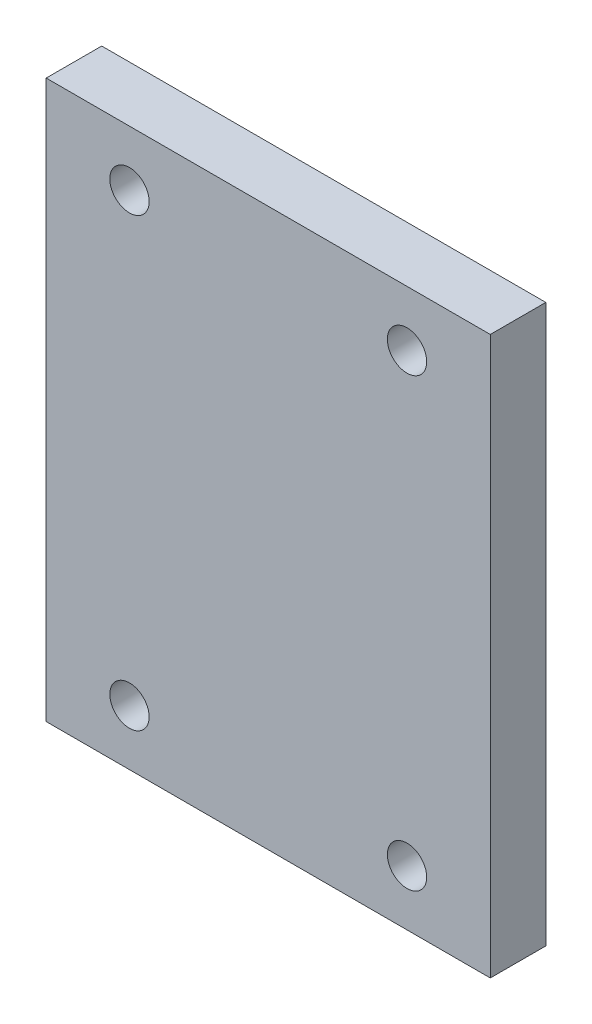
ISO-10303-21;
HEADER;
FILE_DESCRIPTION(('STEP AP214'),'2;1');
FILE_NAME('part.step','',(''),(''),'','','');
FILE_SCHEMA(('AUTOMOTIVE_DESIGN { 1 0 10303 214 1 1 1 1 }'));
ENDSEC;
DATA;
#1=APPLICATION_CONTEXT('core data for automotive mechanical design processes');
#2=APPLICATION_PROTOCOL_DEFINITION('international standard','automotive_design',2000,#1);
#3=PRODUCT_CONTEXT('',#1,'mechanical');
#4=PRODUCT('Part','Part','',(#3));
#5=PRODUCT_RELATED_PRODUCT_CATEGORY('part','',(#4));
#6=PRODUCT_DEFINITION_FORMATION('','',#4);
#7=PRODUCT_DEFINITION_CONTEXT('part definition',#1,'design');
#8=PRODUCT_DEFINITION('design','',#6,#7);
#9=PRODUCT_DEFINITION_SHAPE('','',#8);
#10=(LENGTH_UNIT() NAMED_UNIT(*) SI_UNIT(.MILLI.,.METRE.));
#11=(NAMED_UNIT(*) PLANE_ANGLE_UNIT() SI_UNIT($,.RADIAN.));
#12=(NAMED_UNIT(*) SI_UNIT($,.STERADIAN.) SOLID_ANGLE_UNIT());
#13=UNCERTAINTY_MEASURE_WITH_UNIT(LENGTH_MEASURE(1.E-05),#10,'distance_accuracy_value','');
#14=(GEOMETRIC_REPRESENTATION_CONTEXT(3) GLOBAL_UNCERTAINTY_ASSIGNED_CONTEXT((#13)) GLOBAL_UNIT_ASSIGNED_CONTEXT((#10,
#11,#12)) REPRESENTATION_CONTEXT('',''));
#15=CARTESIAN_POINT('',(0.,0.,0.));
#16=DIRECTION('',(0.,0.,1.));
#17=DIRECTION('',(1.,0.,0.));
#18=AXIS2_PLACEMENT_3D('',#15,#16,#17);
#19=CARTESIAN_POINT('',(-25.4,-31.877,6.35));
#20=DIRECTION('',(1.,0.,0.));
#21=DIRECTION('',(0.,0.,-1.));
#22=AXIS2_PLACEMENT_3D('',#19,#20,#21);
#23=PLANE('',#22);
#24=DIRECTION('',(0.,-1.,0.));
#25=VECTOR('',#24,1.);
#26=CARTESIAN_POINT('',(-25.4,-31.877,0.));
#27=LINE('',#26,#25);
#28=CARTESIAN_POINT('',(-25.4,31.877,0.));
#29=VERTEX_POINT('',#28);
#30=CARTESIAN_POINT('',(-25.4,-31.877,0.));
#31=VERTEX_POINT('',#30);
#32=EDGE_CURVE('E96',#29,#31,#27,.T.);
#33=ORIENTED_EDGE('',*,*,#32,.T.);
#34=DIRECTION('',(0.,0.,-1.));
#35=VECTOR('',#34,1.);
#36=CARTESIAN_POINT('',(-25.4,-31.877,6.35));
#37=LINE('',#36,#35);
#38=CARTESIAN_POINT('',(-25.4,-31.877,6.35));
#39=VERTEX_POINT('',#38);
#40=EDGE_CURVE('E11',#39,#31,#37,.T.);
#41=ORIENTED_EDGE('',*,*,#40,.F.);
#42=DIRECTION('',(0.,-1.,0.));
#43=VECTOR('',#42,1.);
#44=CARTESIAN_POINT('',(-25.4,-31.877,6.35));
#45=LINE('',#44,#43);
#46=CARTESIAN_POINT('',(-25.4,31.877,6.35));
#47=VERTEX_POINT('',#46);
#48=EDGE_CURVE('E84',#47,#39,#45,.T.);
#49=ORIENTED_EDGE('',*,*,#48,.F.);
#50=DIRECTION('',(0.,0.,-1.));
#51=VECTOR('',#50,1.);
#52=CARTESIAN_POINT('',(-25.4,31.877,6.35));
#53=LINE('',#52,#51);
#54=EDGE_CURVE('E92',#47,#29,#53,.T.);
#55=ORIENTED_EDGE('',*,*,#54,.T.);
#56=EDGE_LOOP('',(#33,#41,#49,#55));
#57=FACE_BOUND('',#56,.T.);
#58=ADVANCED_FACE('F33',(#57),#23,.F.);
#59=CARTESIAN_POINT('',(25.4,-31.877,6.35));
#60=DIRECTION('',(0.,1.,0.));
#61=DIRECTION('',(0.,0.,1.));
#62=AXIS2_PLACEMENT_3D('',#59,#60,#61);
#63=PLANE('',#62);
#64=DIRECTION('',(1.,0.,0.));
#65=VECTOR('',#64,1.);
#66=CARTESIAN_POINT('',(25.4,-31.877,0.));
#67=LINE('',#66,#65);
#68=CARTESIAN_POINT('',(25.4,-31.877,0.));
#69=VERTEX_POINT('',#68);
#70=EDGE_CURVE('E88',#31,#69,#67,.T.);
#71=ORIENTED_EDGE('',*,*,#70,.T.);
#72=DIRECTION('',(0.,0.,-1.));
#73=VECTOR('',#72,1.);
#74=CARTESIAN_POINT('',(25.4,-31.877,6.35));
#75=LINE('',#74,#73);
#76=CARTESIAN_POINT('',(25.4,-31.877,6.35));
#77=VERTEX_POINT('',#76);
#78=EDGE_CURVE('E41',#77,#69,#75,.T.);
#79=ORIENTED_EDGE('',*,*,#78,.F.);
#80=DIRECTION('',(1.,0.,0.));
#81=VECTOR('',#80,1.);
#82=CARTESIAN_POINT('',(25.4,-31.877,6.35));
#83=LINE('',#82,#81);
#84=EDGE_CURVE('E79',#39,#77,#83,.T.);
#85=ORIENTED_EDGE('',*,*,#84,.F.);
#86=ORIENTED_EDGE('',*,*,#40,.T.);
#87=EDGE_LOOP('',(#71,#79,#85,#86));
#88=FACE_BOUND('',#87,.T.);
#89=ADVANCED_FACE('F87',(#88),#63,.F.);
#90=CARTESIAN_POINT('',(25.4,-31.877,6.35));
#91=DIRECTION('',(-1.,0.,0.));
#92=DIRECTION('',(0.,0.,1.));
#93=AXIS2_PLACEMENT_3D('',#90,#91,#92);
#94=PLANE('',#93);
#95=DIRECTION('',(0.,1.,0.));
#96=VECTOR('',#95,1.);
#97=CARTESIAN_POINT('',(25.4,-31.877,0.));
#98=LINE('',#97,#96);
#99=CARTESIAN_POINT('',(25.4,31.877,0.));
#100=VERTEX_POINT('',#99);
#101=EDGE_CURVE('E66',#69,#100,#98,.T.);
#102=ORIENTED_EDGE('',*,*,#101,.T.);
#103=DIRECTION('',(0.,0.,-1.));
#104=VECTOR('',#103,1.);
#105=CARTESIAN_POINT('',(25.4,31.877,6.35));
#106=LINE('',#105,#104);
#107=CARTESIAN_POINT('',(25.4,31.877,6.35));
#108=VERTEX_POINT('',#107);
#109=EDGE_CURVE('E89',#108,#100,#106,.T.);
#110=ORIENTED_EDGE('',*,*,#109,.F.);
#111=DIRECTION('',(0.,1.,0.));
#112=VECTOR('',#111,1.);
#113=CARTESIAN_POINT('',(25.4,-31.877,6.35));
#114=LINE('',#113,#112);
#115=EDGE_CURVE('E82',#77,#108,#114,.T.);
#116=ORIENTED_EDGE('',*,*,#115,.F.);
#117=ORIENTED_EDGE('',*,*,#78,.T.);
#118=EDGE_LOOP('',(#102,#110,#116,#117));
#119=FACE_BOUND('',#118,.T.);
#120=ADVANCED_FACE('F90',(#119),#94,.F.);
#121=CARTESIAN_POINT('',(25.4,31.877,6.35));
#122=DIRECTION('',(0.,-1.,0.));
#123=DIRECTION('',(0.,0.,-1.));
#124=AXIS2_PLACEMENT_3D('',#121,#122,#123);
#125=PLANE('',#124);
#126=DIRECTION('',(-1.,0.,0.));
#127=VECTOR('',#126,1.);
#128=CARTESIAN_POINT('',(25.4,31.877,0.));
#129=LINE('',#128,#127);
#130=EDGE_CURVE('E72',#100,#29,#129,.T.);
#131=ORIENTED_EDGE('',*,*,#130,.T.);
#132=ORIENTED_EDGE('',*,*,#54,.F.);
#133=DIRECTION('',(-1.,0.,0.));
#134=VECTOR('',#133,1.);
#135=CARTESIAN_POINT('',(25.4,31.877,6.35));
#136=LINE('',#135,#134);
#137=EDGE_CURVE('E49',#108,#47,#136,.T.);
#138=ORIENTED_EDGE('',*,*,#137,.F.);
#139=ORIENTED_EDGE('',*,*,#109,.T.);
#140=EDGE_LOOP('',(#131,#132,#138,#139));
#141=FACE_BOUND('',#140,.T.);
#142=ADVANCED_FACE('F104',(#141),#125,.F.);
#143=CARTESIAN_POINT('',(0.,0.,6.35));
#144=DIRECTION('',(0.,0.,1.));
#145=DIRECTION('',(1.,0.,0.));
#146=AXIS2_PLACEMENT_3D('',#143,#144,#145);
#147=PLANE('',#146);
#148=CARTESIAN_POINT('',(15.8749999999999,25.527,6.35));
#149=DIRECTION('',(0.,0.,-1.));
#150=DIRECTION('',(-1.,0.,0.));
#151=AXIS2_PLACEMENT_3D('',#148,#149,#150);
#152=CIRCLE('',#151,2.25);
#153=CARTESIAN_POINT('',(13.6249999999999,25.527,6.35));
#154=VERTEX_POINT('',#153);
#155=EDGE_CURVE('E127',#154,#154,#152,.T.);
#156=ORIENTED_EDGE('',*,*,#155,.T.);
#157=EDGE_LOOP('',(#156));
#158=FACE_BOUND('',#157,.T.);
#159=CARTESIAN_POINT('',(-15.8750000000001,25.527,6.35));
#160=DIRECTION('',(0.,0.,-1.));
#161=DIRECTION('',(-1.,0.,0.));
#162=AXIS2_PLACEMENT_3D('',#159,#160,#161);
#163=CIRCLE('',#162,2.25);
#164=CARTESIAN_POINT('',(-18.1250000000001,25.527,6.35));
#165=VERTEX_POINT('',#164);
#166=EDGE_CURVE('E121',#165,#165,#163,.T.);
#167=ORIENTED_EDGE('',*,*,#166,.T.);
#168=EDGE_LOOP('',(#167));
#169=FACE_BOUND('',#168,.T.);
#170=CARTESIAN_POINT('',(-15.8750000000001,-25.527,6.35));
#171=DIRECTION('',(0.,0.,-1.));
#172=DIRECTION('',(-1.,0.,0.));
#173=AXIS2_PLACEMENT_3D('',#170,#171,#172);
#174=CIRCLE('',#173,2.25);
#175=CARTESIAN_POINT('',(-18.1250000000001,-25.527,6.35));
#176=VERTEX_POINT('',#175);
#177=EDGE_CURVE('E115',#176,#176,#174,.T.);
#178=ORIENTED_EDGE('',*,*,#177,.T.);
#179=EDGE_LOOP('',(#178));
#180=FACE_BOUND('',#179,.T.);
#181=CARTESIAN_POINT('',(15.8749999999999,-25.527,6.35));
#182=DIRECTION('',(0.,0.,-1.));
#183=DIRECTION('',(-1.,0.,0.));
#184=AXIS2_PLACEMENT_3D('',#181,#182,#183);
#185=CIRCLE('',#184,2.25);
#186=CARTESIAN_POINT('',(13.6249999999999,-25.527,6.35));
#187=VERTEX_POINT('',#186);
#188=EDGE_CURVE('E99',#187,#187,#185,.T.);
#189=ORIENTED_EDGE('',*,*,#188,.T.);
#190=EDGE_LOOP('',(#189));
#191=FACE_BOUND('',#190,.T.);
#192=ORIENTED_EDGE('',*,*,#48,.T.);
#193=ORIENTED_EDGE('',*,*,#84,.T.);
#194=ORIENTED_EDGE('',*,*,#115,.T.);
#195=ORIENTED_EDGE('',*,*,#137,.T.);
#196=EDGE_LOOP('',(#192,#193,#194,#195));
#197=FACE_BOUND('',#196,.T.);
#198=ADVANCED_FACE('F80',(#158,#169,#180,#191,#197),#147,.T.);
#199=CARTESIAN_POINT('',(0.,0.,0.));
#200=DIRECTION('',(0.,0.,1.));
#201=DIRECTION('',(1.,0.,0.));
#202=AXIS2_PLACEMENT_3D('',#199,#200,#201);
#203=PLANE('',#202);
#204=CARTESIAN_POINT('',(15.8749999999999,25.527,0.));
#205=DIRECTION('',(0.,0.,-1.));
#206=DIRECTION('',(-1.,0.,0.));
#207=AXIS2_PLACEMENT_3D('',#204,#205,#206);
#208=CIRCLE('',#207,2.24999999999999);
#209=CARTESIAN_POINT('',(13.6249999999999,25.527,0.));
#210=VERTEX_POINT('',#209);
#211=EDGE_CURVE('E130',#210,#210,#208,.T.);
#212=ORIENTED_EDGE('',*,*,#211,.F.);
#213=EDGE_LOOP('',(#212));
#214=FACE_BOUND('',#213,.T.);
#215=CARTESIAN_POINT('',(-15.8750000000001,25.527,0.));
#216=DIRECTION('',(0.,0.,-1.));
#217=DIRECTION('',(-1.,0.,0.));
#218=AXIS2_PLACEMENT_3D('',#215,#216,#217);
#219=CIRCLE('',#218,2.24999999999999);
#220=CARTESIAN_POINT('',(-18.1250000000001,25.527,0.));
#221=VERTEX_POINT('',#220);
#222=EDGE_CURVE('E124',#221,#221,#219,.T.);
#223=ORIENTED_EDGE('',*,*,#222,.F.);
#224=EDGE_LOOP('',(#223));
#225=FACE_BOUND('',#224,.T.);
#226=CARTESIAN_POINT('',(-15.8750000000001,-25.527,0.));
#227=DIRECTION('',(0.,0.,-1.));
#228=DIRECTION('',(-1.,0.,0.));
#229=AXIS2_PLACEMENT_3D('',#226,#227,#228);
#230=CIRCLE('',#229,2.24999999999999);
#231=CARTESIAN_POINT('',(-18.1250000000001,-25.527,0.));
#232=VERTEX_POINT('',#231);
#233=EDGE_CURVE('E118',#232,#232,#230,.T.);
#234=ORIENTED_EDGE('',*,*,#233,.F.);
#235=EDGE_LOOP('',(#234));
#236=FACE_BOUND('',#235,.T.);
#237=CARTESIAN_POINT('',(15.8749999999999,-25.527,0.));
#238=DIRECTION('',(0.,0.,-1.));
#239=DIRECTION('',(-1.,0.,0.));
#240=AXIS2_PLACEMENT_3D('',#237,#238,#239);
#241=CIRCLE('',#240,2.24999999999999);
#242=CARTESIAN_POINT('',(13.6249999999999,-25.527,0.));
#243=VERTEX_POINT('',#242);
#244=EDGE_CURVE('E112',#243,#243,#241,.T.);
#245=ORIENTED_EDGE('',*,*,#244,.F.);
#246=EDGE_LOOP('',(#245));
#247=FACE_BOUND('',#246,.T.);
#248=ORIENTED_EDGE('',*,*,#32,.F.);
#249=ORIENTED_EDGE('',*,*,#130,.F.);
#250=ORIENTED_EDGE('',*,*,#101,.F.);
#251=ORIENTED_EDGE('',*,*,#70,.F.);
#252=EDGE_LOOP('',(#248,#249,#250,#251));
#253=FACE_BOUND('',#252,.T.);
#254=ADVANCED_FACE('F107',(#214,#225,#236,#247,#253),#203,.F.);
#255=CARTESIAN_POINT('',(15.8749999999999,-25.527,0.));
#256=DIRECTION('',(0.,0.,-1.));
#257=DIRECTION('',(-1.,0.,0.));
#258=AXIS2_PLACEMENT_3D('',#255,#256,#257);
#259=CYLINDRICAL_SURFACE('',#258,2.24999999999999);
#260=ORIENTED_EDGE('',*,*,#188,.F.);
#261=EDGE_LOOP('',(#260));
#262=FACE_BOUND('',#261,.T.);
#263=ORIENTED_EDGE('',*,*,#244,.T.);
#264=EDGE_LOOP('',(#263));
#265=FACE_BOUND('',#264,.T.);
#266=ADVANCED_FACE('F138',(#262,#265),#259,.F.);
#267=CARTESIAN_POINT('',(-15.8750000000001,-25.527,0.));
#268=DIRECTION('',(0.,0.,-1.));
#269=DIRECTION('',(-1.,0.,0.));
#270=AXIS2_PLACEMENT_3D('',#267,#268,#269);
#271=CYLINDRICAL_SURFACE('',#270,2.24999999999999);
#272=ORIENTED_EDGE('',*,*,#177,.F.);
#273=EDGE_LOOP('',(#272));
#274=FACE_BOUND('',#273,.T.);
#275=ORIENTED_EDGE('',*,*,#233,.T.);
#276=EDGE_LOOP('',(#275));
#277=FACE_BOUND('',#276,.T.);
#278=ADVANCED_FACE('F147',(#274,#277),#271,.F.);
#279=CARTESIAN_POINT('',(-15.8750000000001,25.527,0.));
#280=DIRECTION('',(0.,0.,-1.));
#281=DIRECTION('',(-1.,0.,0.));
#282=AXIS2_PLACEMENT_3D('',#279,#280,#281);
#283=CYLINDRICAL_SURFACE('',#282,2.24999999999999);
#284=ORIENTED_EDGE('',*,*,#166,.F.);
#285=EDGE_LOOP('',(#284));
#286=FACE_BOUND('',#285,.T.);
#287=ORIENTED_EDGE('',*,*,#222,.T.);
#288=EDGE_LOOP('',(#287));
#289=FACE_BOUND('',#288,.T.);
#290=ADVANCED_FACE('F153',(#286,#289),#283,.F.);
#291=CARTESIAN_POINT('',(15.8749999999999,25.527,0.));
#292=DIRECTION('',(0.,0.,-1.));
#293=DIRECTION('',(-1.,0.,0.));
#294=AXIS2_PLACEMENT_3D('',#291,#292,#293);
#295=CYLINDRICAL_SURFACE('',#294,2.24999999999999);
#296=ORIENTED_EDGE('',*,*,#155,.F.);
#297=EDGE_LOOP('',(#296));
#298=FACE_BOUND('',#297,.T.);
#299=ORIENTED_EDGE('',*,*,#211,.T.);
#300=EDGE_LOOP('',(#299));
#301=FACE_BOUND('',#300,.T.);
#302=ADVANCED_FACE('F134',(#298,#301),#295,.F.);
#303=CLOSED_SHELL('',(#58,#89,#120,#142,#198,#254,#266,#278,#290,#302));
#304=MANIFOLD_SOLID_BREP('B2',#303);
#305=ADVANCED_BREP_SHAPE_REPRESENTATION('',(#18,#304),#14);
#306=SHAPE_DEFINITION_REPRESENTATION(#9,#305);
ENDSEC;
END-ISO-10303-21;
